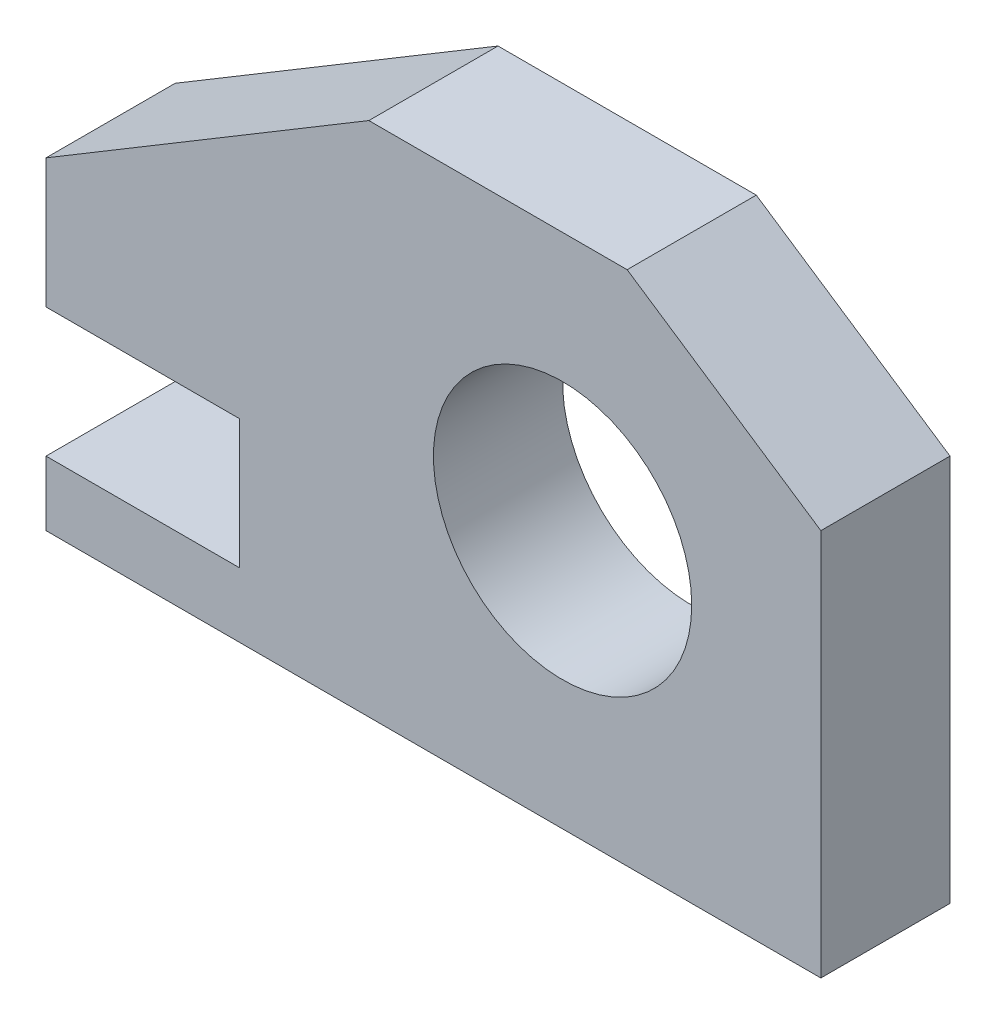
ISO-10303-21;
HEADER;
FILE_DESCRIPTION(('STEP AP214'),'2;1');
FILE_NAME('part.step','',(''),(''),'','','');
FILE_SCHEMA(('AUTOMOTIVE_DESIGN { 1 0 10303 214 1 1 1 1 }'));
ENDSEC;
DATA;
#1=APPLICATION_CONTEXT('core data for automotive mechanical design processes');
#2=APPLICATION_PROTOCOL_DEFINITION('international standard','automotive_design',2000,#1);
#3=PRODUCT_CONTEXT('',#1,'mechanical');
#4=PRODUCT('Part','Part','',(#3));
#5=PRODUCT_RELATED_PRODUCT_CATEGORY('part','',(#4));
#6=PRODUCT_DEFINITION_FORMATION('','',#4);
#7=PRODUCT_DEFINITION_CONTEXT('part definition',#1,'design');
#8=PRODUCT_DEFINITION('design','',#6,#7);
#9=PRODUCT_DEFINITION_SHAPE('','',#8);
#10=(LENGTH_UNIT() NAMED_UNIT(*) SI_UNIT(.MILLI.,.METRE.));
#11=(NAMED_UNIT(*) PLANE_ANGLE_UNIT() SI_UNIT($,.RADIAN.));
#12=(NAMED_UNIT(*) SI_UNIT($,.STERADIAN.) SOLID_ANGLE_UNIT());
#13=UNCERTAINTY_MEASURE_WITH_UNIT(LENGTH_MEASURE(1.E-05),#10,'distance_accuracy_value','');
#14=(GEOMETRIC_REPRESENTATION_CONTEXT(3) GLOBAL_UNCERTAINTY_ASSIGNED_CONTEXT((#13)) GLOBAL_UNIT_ASSIGNED_CONTEXT((#10,
#11,#12)) REPRESENTATION_CONTEXT('',''));
#15=CARTESIAN_POINT('',(0.,0.,0.));
#16=DIRECTION('',(0.,0.,1.));
#17=DIRECTION('',(1.,0.,0.));
#18=AXIS2_PLACEMENT_3D('',#15,#16,#17);
#19=CARTESIAN_POINT('',(0.,0.,12.7));
#20=DIRECTION('',(0.,0.,1.));
#21=DIRECTION('',(1.,0.,0.));
#22=AXIS2_PLACEMENT_3D('',#19,#20,#21);
#23=PLANE('',#22);
#24=DIRECTION('',(1.,0.,0.));
#25=VECTOR('',#24,1.);
#26=CARTESIAN_POINT('',(-76.2,0.,12.7));
#27=LINE('',#26,#25);
#28=CARTESIAN_POINT('',(-76.2,0.,12.7));
#29=VERTEX_POINT('',#28);
#30=CARTESIAN_POINT('',(0.,0.,12.7));
#31=VERTEX_POINT('',#30);
#32=EDGE_CURVE('E161',#29,#31,#27,.T.);
#33=ORIENTED_EDGE('',*,*,#32,.T.);
#34=DIRECTION('',(0.,1.,0.));
#35=VECTOR('',#34,1.);
#36=CARTESIAN_POINT('',(0.,0.,12.7));
#37=LINE('',#36,#35);
#38=CARTESIAN_POINT('',(0.,38.1,12.7));
#39=VERTEX_POINT('',#38);
#40=EDGE_CURVE('E99',#31,#39,#37,.T.);
#41=ORIENTED_EDGE('',*,*,#40,.T.);
#42=DIRECTION('',(-0.832050294337844,0.554700196225229,0.));
#43=VECTOR('',#42,1.);
#44=CARTESIAN_POINT('',(0.,38.1,12.7));
#45=LINE('',#44,#43);
#46=CARTESIAN_POINT('',(-19.05,50.8,12.7));
#47=VERTEX_POINT('',#46);
#48=EDGE_CURVE('E182',#39,#47,#45,.T.);
#49=ORIENTED_EDGE('',*,*,#48,.T.);
#50=DIRECTION('',(-1.,0.,0.));
#51=VECTOR('',#50,1.);
#52=CARTESIAN_POINT('',(-19.05,50.8,12.7));
#53=LINE('',#52,#51);
#54=CARTESIAN_POINT('',(-44.45,50.8,12.7));
#55=VERTEX_POINT('',#54);
#56=EDGE_CURVE('E201',#47,#55,#53,.T.);
#57=ORIENTED_EDGE('',*,*,#56,.T.);
#58=DIRECTION('',(-0.857492925712544,-0.514495755427526,0.));
#59=VECTOR('',#58,1.);
#60=CARTESIAN_POINT('',(-44.45,50.8,12.7));
#61=LINE('',#60,#59);
#62=CARTESIAN_POINT('',(-76.2,31.75,12.7));
#63=VERTEX_POINT('',#62);
#64=EDGE_CURVE('E198',#55,#63,#61,.T.);
#65=ORIENTED_EDGE('',*,*,#64,.T.);
#66=DIRECTION('',(0.,-1.,0.));
#67=VECTOR('',#66,1.);
#68=CARTESIAN_POINT('',(-76.2,31.75,12.7));
#69=LINE('',#68,#67);
#70=CARTESIAN_POINT('',(-76.2,19.05,12.7));
#71=VERTEX_POINT('',#70);
#72=EDGE_CURVE('E200',#63,#71,#69,.T.);
#73=ORIENTED_EDGE('',*,*,#72,.T.);
#74=DIRECTION('',(1.,0.,0.));
#75=VECTOR('',#74,1.);
#76=CARTESIAN_POINT('',(-76.2,19.05,12.7));
#77=LINE('',#76,#75);
#78=CARTESIAN_POINT('',(-57.15,19.05,12.7));
#79=VERTEX_POINT('',#78);
#80=EDGE_CURVE('E124',#71,#79,#77,.T.);
#81=ORIENTED_EDGE('',*,*,#80,.T.);
#82=DIRECTION('',(0.,-1.,0.));
#83=VECTOR('',#82,1.);
#84=CARTESIAN_POINT('',(-57.15,19.05,12.7));
#85=LINE('',#84,#83);
#86=CARTESIAN_POINT('',(-57.15,6.35,12.7));
#87=VERTEX_POINT('',#86);
#88=EDGE_CURVE('E118',#79,#87,#85,.T.);
#89=ORIENTED_EDGE('',*,*,#88,.T.);
#90=DIRECTION('',(-1.,0.,0.));
#91=VECTOR('',#90,1.);
#92=CARTESIAN_POINT('',(-57.15,6.35,12.7));
#93=LINE('',#92,#91);
#94=CARTESIAN_POINT('',(-76.2,6.35,12.7));
#95=VERTEX_POINT('',#94);
#96=EDGE_CURVE('E122',#87,#95,#93,.T.);
#97=ORIENTED_EDGE('',*,*,#96,.T.);
#98=DIRECTION('',(0.,-1.,0.));
#99=VECTOR('',#98,1.);
#100=CARTESIAN_POINT('',(-76.2,6.35,12.7));
#101=LINE('',#100,#99);
#102=EDGE_CURVE('E50',#95,#29,#101,.T.);
#103=ORIENTED_EDGE('',*,*,#102,.T.);
#104=EDGE_LOOP('',(#33,#41,#49,#57,#65,#73,#81,#89,#97,#103));
#105=FACE_BOUND('',#104,.T.);
#106=CARTESIAN_POINT('',(-25.4,25.4,12.7));
#107=DIRECTION('',(0.,0.,1.));
#108=DIRECTION('',(1.,0.,0.));
#109=AXIS2_PLACEMENT_3D('',#106,#107,#108);
#110=CIRCLE('',#109,12.7);
#111=CARTESIAN_POINT('',(-12.7,25.4,12.7));
#112=VERTEX_POINT('',#111);
#113=EDGE_CURVE('E146',#112,#112,#110,.T.);
#114=ORIENTED_EDGE('',*,*,#113,.F.);
#115=EDGE_LOOP('',(#114));
#116=FACE_BOUND('',#115,.T.);
#117=ADVANCED_FACE('F33',(#105,#116),#23,.T.);
#118=CARTESIAN_POINT('',(0.,0.,0.));
#119=DIRECTION('',(0.,0.,1.));
#120=DIRECTION('',(1.,0.,0.));
#121=AXIS2_PLACEMENT_3D('',#118,#119,#120);
#122=PLANE('',#121);
#123=DIRECTION('',(1.,0.,0.));
#124=VECTOR('',#123,1.);
#125=CARTESIAN_POINT('',(-76.2,0.,0.));
#126=LINE('',#125,#124);
#127=CARTESIAN_POINT('',(-76.2,0.,0.));
#128=VERTEX_POINT('',#127);
#129=CARTESIAN_POINT('',(0.,0.,0.));
#130=VERTEX_POINT('',#129);
#131=EDGE_CURVE('E142',#128,#130,#126,.T.);
#132=ORIENTED_EDGE('',*,*,#131,.F.);
#133=DIRECTION('',(0.,-1.,0.));
#134=VECTOR('',#133,1.);
#135=CARTESIAN_POINT('',(-76.2,6.35,0.));
#136=LINE('',#135,#134);
#137=CARTESIAN_POINT('',(-76.2,6.35,0.));
#138=VERTEX_POINT('',#137);
#139=EDGE_CURVE('E91',#138,#128,#136,.T.);
#140=ORIENTED_EDGE('',*,*,#139,.F.);
#141=DIRECTION('',(-1.,0.,0.));
#142=VECTOR('',#141,1.);
#143=CARTESIAN_POINT('',(-57.15,6.35,0.));
#144=LINE('',#143,#142);
#145=CARTESIAN_POINT('',(-57.15,6.35,0.));
#146=VERTEX_POINT('',#145);
#147=EDGE_CURVE('E85',#146,#138,#144,.T.);
#148=ORIENTED_EDGE('',*,*,#147,.F.);
#149=DIRECTION('',(0.,-1.,0.));
#150=VECTOR('',#149,1.);
#151=CARTESIAN_POINT('',(-57.15,19.05,0.));
#152=LINE('',#151,#150);
#153=CARTESIAN_POINT('',(-57.15,19.05,0.));
#154=VERTEX_POINT('',#153);
#155=EDGE_CURVE('E132',#154,#146,#152,.T.);
#156=ORIENTED_EDGE('',*,*,#155,.F.);
#157=DIRECTION('',(1.,0.,0.));
#158=VECTOR('',#157,1.);
#159=CARTESIAN_POINT('',(-76.2,19.05,0.));
#160=LINE('',#159,#158);
#161=CARTESIAN_POINT('',(-76.2,19.05,0.));
#162=VERTEX_POINT('',#161);
#163=EDGE_CURVE('E156',#162,#154,#160,.T.);
#164=ORIENTED_EDGE('',*,*,#163,.F.);
#165=DIRECTION('',(0.,-1.,0.));
#166=VECTOR('',#165,1.);
#167=CARTESIAN_POINT('',(-76.2,31.75,0.));
#168=LINE('',#167,#166);
#169=CARTESIAN_POINT('',(-76.2,31.75,0.));
#170=VERTEX_POINT('',#169);
#171=EDGE_CURVE('E154',#170,#162,#168,.T.);
#172=ORIENTED_EDGE('',*,*,#171,.F.);
#173=DIRECTION('',(-0.857492925712544,-0.514495755427526,0.));
#174=VECTOR('',#173,1.);
#175=CARTESIAN_POINT('',(-44.45,50.8,0.));
#176=LINE('',#175,#174);
#177=CARTESIAN_POINT('',(-44.45,50.8,0.));
#178=VERTEX_POINT('',#177);
#179=EDGE_CURVE('E152',#178,#170,#176,.T.);
#180=ORIENTED_EDGE('',*,*,#179,.F.);
#181=DIRECTION('',(-1.,0.,0.));
#182=VECTOR('',#181,1.);
#183=CARTESIAN_POINT('',(-19.05,50.8,0.));
#184=LINE('',#183,#182);
#185=CARTESIAN_POINT('',(-19.05,50.8,0.));
#186=VERTEX_POINT('',#185);
#187=EDGE_CURVE('E150',#186,#178,#184,.T.);
#188=ORIENTED_EDGE('',*,*,#187,.F.);
#189=DIRECTION('',(-0.832050294337844,0.554700196225229,0.));
#190=VECTOR('',#189,1.);
#191=CARTESIAN_POINT('',(0.,38.1,0.));
#192=LINE('',#191,#190);
#193=CARTESIAN_POINT('',(0.,38.1,0.));
#194=VERTEX_POINT('',#193);
#195=EDGE_CURVE('E148',#194,#186,#192,.T.);
#196=ORIENTED_EDGE('',*,*,#195,.F.);
#197=DIRECTION('',(0.,1.,0.));
#198=VECTOR('',#197,1.);
#199=CARTESIAN_POINT('',(0.,0.,0.));
#200=LINE('',#199,#198);
#201=EDGE_CURVE('E145',#130,#194,#200,.T.);
#202=ORIENTED_EDGE('',*,*,#201,.F.);
#203=EDGE_LOOP('',(#132,#140,#148,#156,#164,#172,#180,#188,#196,#202));
#204=FACE_BOUND('',#203,.T.);
#205=CARTESIAN_POINT('',(-25.4,25.4,0.));
#206=DIRECTION('',(0.,0.,1.));
#207=DIRECTION('',(1.,0.,0.));
#208=AXIS2_PLACEMENT_3D('',#205,#206,#207);
#209=CIRCLE('',#208,12.7);
#210=CARTESIAN_POINT('',(-12.7,25.4,0.));
#211=VERTEX_POINT('',#210);
#212=EDGE_CURVE('E209',#211,#211,#209,.T.);
#213=ORIENTED_EDGE('',*,*,#212,.T.);
#214=EDGE_LOOP('',(#213));
#215=FACE_BOUND('',#214,.T.);
#216=ADVANCED_FACE('F186',(#204,#215),#122,.F.);
#217=CARTESIAN_POINT('',(-76.2,0.,12.7));
#218=DIRECTION('',(0.,1.,0.));
#219=DIRECTION('',(0.,0.,1.));
#220=AXIS2_PLACEMENT_3D('',#217,#218,#219);
#221=PLANE('',#220);
#222=ORIENTED_EDGE('',*,*,#131,.T.);
#223=DIRECTION('',(0.,0.,-1.));
#224=VECTOR('',#223,1.);
#225=CARTESIAN_POINT('',(0.,0.,12.7));
#226=LINE('',#225,#224);
#227=EDGE_CURVE('E11',#31,#130,#226,.T.);
#228=ORIENTED_EDGE('',*,*,#227,.F.);
#229=ORIENTED_EDGE('',*,*,#32,.F.);
#230=DIRECTION('',(0.,0.,-1.));
#231=VECTOR('',#230,1.);
#232=CARTESIAN_POINT('',(-76.2,0.,12.7));
#233=LINE('',#232,#231);
#234=EDGE_CURVE('E138',#29,#128,#233,.T.);
#235=ORIENTED_EDGE('',*,*,#234,.T.);
#236=EDGE_LOOP('',(#222,#228,#229,#235));
#237=FACE_BOUND('',#236,.T.);
#238=ADVANCED_FACE('F35',(#237),#221,.F.);
#239=CARTESIAN_POINT('',(0.,0.,12.7));
#240=DIRECTION('',(-1.,0.,0.));
#241=DIRECTION('',(0.,0.,1.));
#242=AXIS2_PLACEMENT_3D('',#239,#240,#241);
#243=PLANE('',#242);
#244=ORIENTED_EDGE('',*,*,#201,.T.);
#245=DIRECTION('',(0.,0.,-1.));
#246=VECTOR('',#245,1.);
#247=CARTESIAN_POINT('',(0.,38.1,12.7));
#248=LINE('',#247,#246);
#249=EDGE_CURVE('E42',#39,#194,#248,.T.);
#250=ORIENTED_EDGE('',*,*,#249,.F.);
#251=ORIENTED_EDGE('',*,*,#40,.F.);
#252=ORIENTED_EDGE('',*,*,#227,.T.);
#253=EDGE_LOOP('',(#244,#250,#251,#252));
#254=FACE_BOUND('',#253,.T.);
#255=ADVANCED_FACE('F245',(#254),#243,.F.);
#256=CARTESIAN_POINT('',(0.,38.1,12.7));
#257=DIRECTION('',(-0.554700196225229,-0.832050294337844,0.));
#258=DIRECTION('',(0.832050294337844,-0.554700196225229,0.));
#259=AXIS2_PLACEMENT_3D('',#256,#257,#258);
#260=PLANE('',#259);
#261=ORIENTED_EDGE('',*,*,#195,.T.);
#262=DIRECTION('',(0.,0.,-1.));
#263=VECTOR('',#262,1.);
#264=CARTESIAN_POINT('',(-19.05,50.8,12.7));
#265=LINE('',#264,#263);
#266=EDGE_CURVE('E174',#47,#186,#265,.T.);
#267=ORIENTED_EDGE('',*,*,#266,.F.);
#268=ORIENTED_EDGE('',*,*,#48,.F.);
#269=ORIENTED_EDGE('',*,*,#249,.T.);
#270=EDGE_LOOP('',(#261,#267,#268,#269));
#271=FACE_BOUND('',#270,.T.);
#272=ADVANCED_FACE('F180',(#271),#260,.F.);
#273=CARTESIAN_POINT('',(-19.05,50.8,12.7));
#274=DIRECTION('',(0.,-1.,0.));
#275=DIRECTION('',(1.,0.,0.));
#276=AXIS2_PLACEMENT_3D('',#273,#274,#275);
#277=PLANE('',#276);
#278=ORIENTED_EDGE('',*,*,#187,.T.);
#279=DIRECTION('',(0.,0.,-1.));
#280=VECTOR('',#279,1.);
#281=CARTESIAN_POINT('',(-44.45,50.8,12.7));
#282=LINE('',#281,#280);
#283=EDGE_CURVE('E171',#55,#178,#282,.T.);
#284=ORIENTED_EDGE('',*,*,#283,.F.);
#285=ORIENTED_EDGE('',*,*,#56,.F.);
#286=ORIENTED_EDGE('',*,*,#266,.T.);
#287=EDGE_LOOP('',(#278,#284,#285,#286));
#288=FACE_BOUND('',#287,.T.);
#289=ADVANCED_FACE('F192',(#288),#277,.F.);
#290=CARTESIAN_POINT('',(-44.45,50.8,12.7));
#291=DIRECTION('',(0.514495755427526,-0.857492925712544,0.));
#292=DIRECTION('',(0.857492925712544,0.514495755427526,0.));
#293=AXIS2_PLACEMENT_3D('',#290,#291,#292);
#294=PLANE('',#293);
#295=ORIENTED_EDGE('',*,*,#179,.T.);
#296=DIRECTION('',(0.,0.,-1.));
#297=VECTOR('',#296,1.);
#298=CARTESIAN_POINT('',(-76.2,31.75,12.7));
#299=LINE('',#298,#297);
#300=EDGE_CURVE('E168',#63,#170,#299,.T.);
#301=ORIENTED_EDGE('',*,*,#300,.F.);
#302=ORIENTED_EDGE('',*,*,#64,.F.);
#303=ORIENTED_EDGE('',*,*,#283,.T.);
#304=EDGE_LOOP('',(#295,#301,#302,#303));
#305=FACE_BOUND('',#304,.T.);
#306=ADVANCED_FACE('F196',(#305),#294,.F.);
#307=CARTESIAN_POINT('',(-76.2,31.75,12.7));
#308=DIRECTION('',(1.,0.,0.));
#309=DIRECTION('',(0.,0.,-1.));
#310=AXIS2_PLACEMENT_3D('',#307,#308,#309);
#311=PLANE('',#310);
#312=ORIENTED_EDGE('',*,*,#171,.T.);
#313=DIRECTION('',(0.,0.,-1.));
#314=VECTOR('',#313,1.);
#315=CARTESIAN_POINT('',(-76.2,19.05,12.7));
#316=LINE('',#315,#314);
#317=EDGE_CURVE('E165',#71,#162,#316,.T.);
#318=ORIENTED_EDGE('',*,*,#317,.F.);
#319=ORIENTED_EDGE('',*,*,#72,.F.);
#320=ORIENTED_EDGE('',*,*,#300,.T.);
#321=EDGE_LOOP('',(#312,#318,#319,#320));
#322=FACE_BOUND('',#321,.T.);
#323=ADVANCED_FACE('F235',(#322),#311,.F.);
#324=CARTESIAN_POINT('',(-76.2,19.05,12.7));
#325=DIRECTION('',(0.,1.,0.));
#326=DIRECTION('',(0.,0.,1.));
#327=AXIS2_PLACEMENT_3D('',#324,#325,#326);
#328=PLANE('',#327);
#329=ORIENTED_EDGE('',*,*,#163,.T.);
#330=DIRECTION('',(0.,0.,-1.));
#331=VECTOR('',#330,1.);
#332=CARTESIAN_POINT('',(-57.15,19.05,12.7));
#333=LINE('',#332,#331);
#334=EDGE_CURVE('E133',#79,#154,#333,.T.);
#335=ORIENTED_EDGE('',*,*,#334,.F.);
#336=ORIENTED_EDGE('',*,*,#80,.F.);
#337=ORIENTED_EDGE('',*,*,#317,.T.);
#338=EDGE_LOOP('',(#329,#335,#336,#337));
#339=FACE_BOUND('',#338,.T.);
#340=ADVANCED_FACE('F232',(#339),#328,.F.);
#341=CARTESIAN_POINT('',(-57.15,19.05,12.7));
#342=DIRECTION('',(1.,0.,0.));
#343=DIRECTION('',(0.,0.,-1.));
#344=AXIS2_PLACEMENT_3D('',#341,#342,#343);
#345=PLANE('',#344);
#346=ORIENTED_EDGE('',*,*,#155,.T.);
#347=DIRECTION('',(0.,0.,-1.));
#348=VECTOR('',#347,1.);
#349=CARTESIAN_POINT('',(-57.15,6.35,12.7));
#350=LINE('',#349,#348);
#351=EDGE_CURVE('E129',#87,#146,#350,.T.);
#352=ORIENTED_EDGE('',*,*,#351,.F.);
#353=ORIENTED_EDGE('',*,*,#88,.F.);
#354=ORIENTED_EDGE('',*,*,#334,.T.);
#355=EDGE_LOOP('',(#346,#352,#353,#354));
#356=FACE_BOUND('',#355,.T.);
#357=ADVANCED_FACE('F130',(#356),#345,.F.);
#358=CARTESIAN_POINT('',(-57.15,6.35,12.7));
#359=DIRECTION('',(0.,-1.,0.));
#360=DIRECTION('',(1.,0.,0.));
#361=AXIS2_PLACEMENT_3D('',#358,#359,#360);
#362=PLANE('',#361);
#363=ORIENTED_EDGE('',*,*,#147,.T.);
#364=DIRECTION('',(0.,0.,-1.));
#365=VECTOR('',#364,1.);
#366=CARTESIAN_POINT('',(-76.2,6.35,12.7));
#367=LINE('',#366,#365);
#368=EDGE_CURVE('E134',#95,#138,#367,.T.);
#369=ORIENTED_EDGE('',*,*,#368,.F.);
#370=ORIENTED_EDGE('',*,*,#96,.F.);
#371=ORIENTED_EDGE('',*,*,#351,.T.);
#372=EDGE_LOOP('',(#363,#369,#370,#371));
#373=FACE_BOUND('',#372,.T.);
#374=ADVANCED_FACE('F136',(#373),#362,.F.);
#375=CARTESIAN_POINT('',(-76.2,6.35,12.7));
#376=DIRECTION('',(1.,0.,0.));
#377=DIRECTION('',(0.,0.,-1.));
#378=AXIS2_PLACEMENT_3D('',#375,#376,#377);
#379=PLANE('',#378);
#380=ORIENTED_EDGE('',*,*,#139,.T.);
#381=ORIENTED_EDGE('',*,*,#234,.F.);
#382=ORIENTED_EDGE('',*,*,#102,.F.);
#383=ORIENTED_EDGE('',*,*,#368,.T.);
#384=EDGE_LOOP('',(#380,#381,#382,#383));
#385=FACE_BOUND('',#384,.T.);
#386=ADVANCED_FACE('F225',(#385),#379,.F.);
#387=CARTESIAN_POINT('',(-25.4,25.4,12.7));
#388=DIRECTION('',(0.,0.,-1.));
#389=DIRECTION('',(-1.,0.,0.));
#390=AXIS2_PLACEMENT_3D('',#387,#388,#389);
#391=CYLINDRICAL_SURFACE('',#390,12.7);
#392=ORIENTED_EDGE('',*,*,#113,.T.);
#393=EDGE_LOOP('',(#392));
#394=FACE_BOUND('',#393,.T.);
#395=ORIENTED_EDGE('',*,*,#212,.F.);
#396=EDGE_LOOP('',(#395));
#397=FACE_BOUND('',#396,.T.);
#398=ADVANCED_FACE('F215',(#394,#397),#391,.F.);
#399=CLOSED_SHELL('',(#117,#216,#238,#255,#272,#289,#306,#323,#340,#357,#374,#386,#398));
#400=MANIFOLD_SOLID_BREP('B2',#399);
#401=ADVANCED_BREP_SHAPE_REPRESENTATION('',(#18,#400),#14);
#402=SHAPE_DEFINITION_REPRESENTATION(#9,#401);
ENDSEC;
END-ISO-10303-21;
